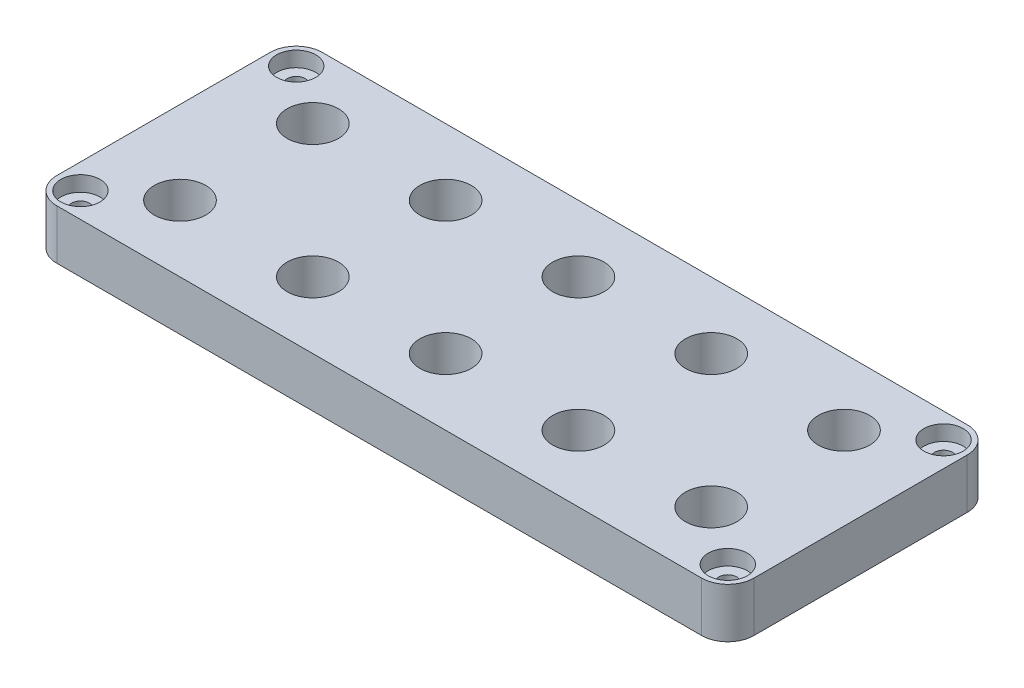
ISO-10303-21;
HEADER;
FILE_DESCRIPTION(('STEP AP214'),'2;1');
FILE_NAME('part.step','',(''),(''),'','','');
FILE_SCHEMA(('AUTOMOTIVE_DESIGN { 1 0 10303 214 1 1 1 1 }'));
ENDSEC;
DATA;
#1=APPLICATION_CONTEXT('core data for automotive mechanical design processes');
#2=APPLICATION_PROTOCOL_DEFINITION('international standard','automotive_design',2000,#1);
#3=PRODUCT_CONTEXT('',#1,'mechanical');
#4=PRODUCT('Part','Part','',(#3));
#5=PRODUCT_RELATED_PRODUCT_CATEGORY('part','',(#4));
#6=PRODUCT_DEFINITION_FORMATION('','',#4);
#7=PRODUCT_DEFINITION_CONTEXT('part definition',#1,'design');
#8=PRODUCT_DEFINITION('design','',#6,#7);
#9=PRODUCT_DEFINITION_SHAPE('','',#8);
#10=(LENGTH_UNIT() NAMED_UNIT(*) SI_UNIT(.MILLI.,.METRE.));
#11=(NAMED_UNIT(*) PLANE_ANGLE_UNIT() SI_UNIT($,.RADIAN.));
#12=(NAMED_UNIT(*) SI_UNIT($,.STERADIAN.) SOLID_ANGLE_UNIT());
#13=UNCERTAINTY_MEASURE_WITH_UNIT(LENGTH_MEASURE(1.E-05),#10,'distance_accuracy_value','');
#14=(GEOMETRIC_REPRESENTATION_CONTEXT(3) GLOBAL_UNCERTAINTY_ASSIGNED_CONTEXT((#13)) GLOBAL_UNIT_ASSIGNED_CONTEXT((#10,
#11,#12)) REPRESENTATION_CONTEXT('',''));
#15=CARTESIAN_POINT('',(0.,0.,0.));
#16=DIRECTION('',(0.,0.,1.));
#17=DIRECTION('',(1.,0.,0.));
#18=AXIS2_PLACEMENT_3D('',#15,#16,#17);
#19=CARTESIAN_POINT('',(9.525,19.05,-9.52500000000001));
#20=DIRECTION('',(0.,-1.,0.));
#21=DIRECTION('',(0.,0.,-1.));
#22=AXIS2_PLACEMENT_3D('',#19,#20,#21);
#23=CYLINDRICAL_SURFACE('',#22,3.42900000000001);
#24=CARTESIAN_POINT('',(9.525,0.,-9.52500000000001));
#25=DIRECTION('',(0.,1.,0.));
#26=DIRECTION('',(0.,0.,-1.));
#27=AXIS2_PLACEMENT_3D('',#24,#25,#26);
#28=CIRCLE('',#27,3.42900000000001);
#29=CARTESIAN_POINT('',(9.525,0.,-12.954));
#30=VERTEX_POINT('',#29);
#31=EDGE_CURVE('E194',#30,#30,#28,.T.);
#32=ORIENTED_EDGE('',*,*,#31,.F.);
#33=EDGE_LOOP('',(#32));
#34=FACE_BOUND('',#33,.T.);
#35=CARTESIAN_POINT('',(9.525,13.208,-9.52500000000001));
#36=DIRECTION('',(0.,1.,0.));
#37=DIRECTION('',(0.,0.,1.));
#38=AXIS2_PLACEMENT_3D('',#35,#36,#37);
#39=CIRCLE('',#38,3.42900000000001);
#40=CARTESIAN_POINT('',(9.525,13.208,-6.096));
#41=VERTEX_POINT('',#40);
#42=EDGE_CURVE('E37',#41,#41,#39,.T.);
#43=ORIENTED_EDGE('',*,*,#42,.T.);
#44=EDGE_LOOP('',(#43));
#45=FACE_BOUND('',#44,.T.);
#46=ADVANCED_FACE('F33',(#34,#45),#23,.F.);
#47=CARTESIAN_POINT('',(257.175,19.05,-9.52499999999998));
#48=DIRECTION('',(0.,-1.,0.));
#49=DIRECTION('',(0.,0.,-1.));
#50=AXIS2_PLACEMENT_3D('',#47,#48,#49);
#51=CYLINDRICAL_SURFACE('',#50,3.42899999999994);
#52=CARTESIAN_POINT('',(257.175,0.,-9.52499999999998));
#53=DIRECTION('',(0.,1.,0.));
#54=DIRECTION('',(0.,0.,1.));
#55=AXIS2_PLACEMENT_3D('',#52,#53,#54);
#56=CIRCLE('',#55,3.42899999999994);
#57=CARTESIAN_POINT('',(257.175,0.,-6.09600000000003));
#58=VERTEX_POINT('',#57);
#59=EDGE_CURVE('E161',#58,#58,#56,.T.);
#60=ORIENTED_EDGE('',*,*,#59,.F.);
#61=EDGE_LOOP('',(#60));
#62=FACE_BOUND('',#61,.T.);
#63=CARTESIAN_POINT('',(257.175,13.208,-9.52499999999998));
#64=DIRECTION('',(0.,1.,0.));
#65=DIRECTION('',(0.,0.,1.));
#66=AXIS2_PLACEMENT_3D('',#63,#64,#65);
#67=CIRCLE('',#66,3.42899999999994);
#68=CARTESIAN_POINT('',(257.175,13.208,-6.09600000000003));
#69=VERTEX_POINT('',#68);
#70=EDGE_CURVE('E167',#69,#69,#67,.T.);
#71=ORIENTED_EDGE('',*,*,#70,.T.);
#72=EDGE_LOOP('',(#71));
#73=FACE_BOUND('',#72,.T.);
#74=ADVANCED_FACE('F293',(#62,#73),#51,.F.);
#75=CARTESIAN_POINT('',(257.175,19.05,-92.075));
#76=DIRECTION('',(0.,-1.,0.));
#77=DIRECTION('',(0.,0.,-1.));
#78=AXIS2_PLACEMENT_3D('',#75,#76,#77);
#79=CYLINDRICAL_SURFACE('',#78,3.42899999999994);
#80=CARTESIAN_POINT('',(257.175,0.,-92.075));
#81=DIRECTION('',(0.,1.,0.));
#82=DIRECTION('',(0.,0.,-1.));
#83=AXIS2_PLACEMENT_3D('',#80,#81,#82);
#84=CIRCLE('',#83,3.42899999999994);
#85=CARTESIAN_POINT('',(257.175,0.,-95.504));
#86=VERTEX_POINT('',#85);
#87=EDGE_CURVE('E197',#86,#86,#84,.T.);
#88=ORIENTED_EDGE('',*,*,#87,.F.);
#89=EDGE_LOOP('',(#88));
#90=FACE_BOUND('',#89,.T.);
#91=CARTESIAN_POINT('',(257.175,13.208,-92.075));
#92=DIRECTION('',(0.,1.,0.));
#93=DIRECTION('',(0.,0.,1.));
#94=AXIS2_PLACEMENT_3D('',#91,#92,#93);
#95=CIRCLE('',#94,3.42899999999994);
#96=CARTESIAN_POINT('',(257.175,13.208,-88.6460000000001));
#97=VERTEX_POINT('',#96);
#98=EDGE_CURVE('E163',#97,#97,#95,.T.);
#99=ORIENTED_EDGE('',*,*,#98,.T.);
#100=EDGE_LOOP('',(#99));
#101=FACE_BOUND('',#100,.T.);
#102=ADVANCED_FACE('F299',(#90,#101),#79,.F.);
#103=CARTESIAN_POINT('',(9.525,19.05,-92.075));
#104=DIRECTION('',(0.,-1.,0.));
#105=DIRECTION('',(0.,0.,-1.));
#106=AXIS2_PLACEMENT_3D('',#103,#104,#105);
#107=CYLINDRICAL_SURFACE('',#106,3.42900000000001);
#108=CARTESIAN_POINT('',(9.525,0.,-92.075));
#109=DIRECTION('',(0.,1.,0.));
#110=DIRECTION('',(0.,0.,1.));
#111=AXIS2_PLACEMENT_3D('',#108,#109,#110);
#112=CIRCLE('',#111,3.42900000000001);
#113=CARTESIAN_POINT('',(9.525,0.,-88.646));
#114=VERTEX_POINT('',#113);
#115=EDGE_CURVE('E200',#114,#114,#112,.T.);
#116=ORIENTED_EDGE('',*,*,#115,.F.);
#117=EDGE_LOOP('',(#116));
#118=FACE_BOUND('',#117,.T.);
#119=CARTESIAN_POINT('',(9.525,13.208,-92.075));
#120=DIRECTION('',(0.,1.,0.));
#121=DIRECTION('',(0.,0.,1.));
#122=AXIS2_PLACEMENT_3D('',#119,#120,#121);
#123=CIRCLE('',#122,3.42900000000001);
#124=CARTESIAN_POINT('',(9.525,13.208,-88.646));
#125=VERTEX_POINT('',#124);
#126=EDGE_CURVE('E158',#125,#125,#123,.T.);
#127=ORIENTED_EDGE('',*,*,#126,.T.);
#128=EDGE_LOOP('',(#127));
#129=FACE_BOUND('',#128,.T.);
#130=ADVANCED_FACE('F308',(#118,#129),#107,.F.);
#131=CARTESIAN_POINT('',(0.,19.05,0.));
#132=DIRECTION('',(0.,-1.,0.));
#133=DIRECTION('',(0.,0.,-1.));
#134=AXIS2_PLACEMENT_3D('',#131,#132,#133);
#135=PLANE('',#134);
#136=CARTESIAN_POINT('',(9.52500000000086,19.05,-9.52499999999999));
#137=DIRECTION('',(0.,1.,0.));
#138=DIRECTION('',(0.,0.,1.));
#139=AXIS2_PLACEMENT_3D('',#136,#137,#138);
#140=CIRCLE('',#139,7.5);
#141=CARTESIAN_POINT('',(9.52500000000086,19.05,-2.02499999999999));
#142=VERTEX_POINT('',#141);
#143=EDGE_CURVE('E183',#142,#142,#140,.T.);
#144=ORIENTED_EDGE('',*,*,#143,.F.);
#145=EDGE_LOOP('',(#144));
#146=FACE_BOUND('',#145,.T.);
#147=CARTESIAN_POINT('',(257.175000000001,19.05,-9.52499999999999));
#148=DIRECTION('',(0.,1.,0.));
#149=DIRECTION('',(0.,0.,1.));
#150=AXIS2_PLACEMENT_3D('',#147,#148,#149);
#151=CIRCLE('',#150,7.50000000000001);
#152=CARTESIAN_POINT('',(257.175000000001,19.05,-2.02499999999998));
#153=VERTEX_POINT('',#152);
#154=EDGE_CURVE('E176',#153,#153,#151,.T.);
#155=ORIENTED_EDGE('',*,*,#154,.F.);
#156=EDGE_LOOP('',(#155));
#157=FACE_BOUND('',#156,.T.);
#158=CARTESIAN_POINT('',(257.175,19.05,-92.075));
#159=DIRECTION('',(0.,1.,0.));
#160=DIRECTION('',(0.,0.,1.));
#161=AXIS2_PLACEMENT_3D('',#158,#159,#160);
#162=CIRCLE('',#161,7.50000000000001);
#163=CARTESIAN_POINT('',(257.175,19.05,-84.575));
#164=VERTEX_POINT('',#163);
#165=EDGE_CURVE('E169',#164,#164,#162,.T.);
#166=ORIENTED_EDGE('',*,*,#165,.F.);
#167=EDGE_LOOP('',(#166));
#168=FACE_BOUND('',#167,.T.);
#169=CARTESIAN_POINT('',(9.525,19.05,-92.075));
#170=DIRECTION('',(0.,1.,0.));
#171=DIRECTION('',(0.,0.,1.));
#172=AXIS2_PLACEMENT_3D('',#169,#170,#171);
#173=CIRCLE('',#172,7.5);
#174=CARTESIAN_POINT('',(9.525,19.05,-84.575));
#175=VERTEX_POINT('',#174);
#176=EDGE_CURVE('E165',#175,#175,#173,.T.);
#177=ORIENTED_EDGE('',*,*,#176,.F.);
#178=EDGE_LOOP('',(#177));
#179=FACE_BOUND('',#178,.T.);
#180=CARTESIAN_POINT('',(234.95,19.05,-76.2));
#181=DIRECTION('',(0.,1.,0.));
#182=DIRECTION('',(0.,0.,1.));
#183=AXIS2_PLACEMENT_3D('',#180,#181,#182);
#184=CIRCLE('',#183,9.8425);
#185=CARTESIAN_POINT('',(234.95,19.05,-66.3575));
#186=VERTEX_POINT('',#185);
#187=EDGE_CURVE('E210',#186,#186,#184,.T.);
#188=ORIENTED_EDGE('',*,*,#187,.F.);
#189=EDGE_LOOP('',(#188));
#190=FACE_BOUND('',#189,.T.);
#191=CARTESIAN_POINT('',(133.35,19.05,-76.2));
#192=DIRECTION('',(0.,1.,0.));
#193=DIRECTION('',(0.,0.,1.));
#194=AXIS2_PLACEMENT_3D('',#191,#192,#193);
#195=CIRCLE('',#194,9.8425);
#196=CARTESIAN_POINT('',(133.35,19.05,-66.3575));
#197=VERTEX_POINT('',#196);
#198=EDGE_CURVE('E222',#197,#197,#195,.T.);
#199=ORIENTED_EDGE('',*,*,#198,.F.);
#200=EDGE_LOOP('',(#199));
#201=FACE_BOUND('',#200,.T.);
#202=CARTESIAN_POINT('',(234.95,19.05,-25.4));
#203=DIRECTION('',(0.,1.,0.));
#204=DIRECTION('',(0.,0.,1.));
#205=AXIS2_PLACEMENT_3D('',#202,#203,#204);
#206=CIRCLE('',#205,9.8425);
#207=CARTESIAN_POINT('',(234.95,19.05,-15.5575));
#208=VERTEX_POINT('',#207);
#209=EDGE_CURVE('E234',#208,#208,#206,.T.);
#210=ORIENTED_EDGE('',*,*,#209,.F.);
#211=EDGE_LOOP('',(#210));
#212=FACE_BOUND('',#211,.T.);
#213=CARTESIAN_POINT('',(133.35,19.05,-25.4));
#214=DIRECTION('',(0.,1.,0.));
#215=DIRECTION('',(0.,0.,1.));
#216=AXIS2_PLACEMENT_3D('',#213,#214,#215);
#217=CIRCLE('',#216,9.8425);
#218=CARTESIAN_POINT('',(133.35,19.05,-15.5575));
#219=VERTEX_POINT('',#218);
#220=EDGE_CURVE('E246',#219,#219,#217,.T.);
#221=ORIENTED_EDGE('',*,*,#220,.F.);
#222=EDGE_LOOP('',(#221));
#223=FACE_BOUND('',#222,.T.);
#224=CARTESIAN_POINT('',(31.75,19.05,-25.4));
#225=DIRECTION('',(0.,1.,0.));
#226=DIRECTION('',(0.,0.,1.));
#227=AXIS2_PLACEMENT_3D('',#224,#225,#226);
#228=CIRCLE('',#227,9.8425);
#229=CARTESIAN_POINT('',(31.75,19.05,-15.5575));
#230=VERTEX_POINT('',#229);
#231=EDGE_CURVE('E258',#230,#230,#228,.T.);
#232=ORIENTED_EDGE('',*,*,#231,.F.);
#233=EDGE_LOOP('',(#232));
#234=FACE_BOUND('',#233,.T.);
#235=DIRECTION('',(0.,0.,-1.));
#236=VECTOR('',#235,1.);
#237=CARTESIAN_POINT('',(266.7,19.05,0.));
#238=LINE('',#237,#236);
#239=CARTESIAN_POINT('',(266.7,19.05,-10.));
#240=VERTEX_POINT('',#239);
#241=CARTESIAN_POINT('',(266.7,19.05,-91.6));
#242=VERTEX_POINT('',#241);
#243=EDGE_CURVE('E265',#240,#242,#238,.T.);
#244=ORIENTED_EDGE('',*,*,#243,.T.);
#245=CARTESIAN_POINT('',(256.7,19.05,-91.6));
#246=DIRECTION('',(0.,-1.,0.));
#247=DIRECTION('',(0.,0.,-1.));
#248=AXIS2_PLACEMENT_3D('',#245,#246,#247);
#249=CIRCLE('',#248,10.);
#250=CARTESIAN_POINT('',(256.7,19.05,-101.6));
#251=VERTEX_POINT('',#250);
#252=EDGE_CURVE('E150',#242,#251,#249,.F.);
#253=ORIENTED_EDGE('',*,*,#252,.T.);
#254=DIRECTION('',(-1.,0.,0.));
#255=VECTOR('',#254,1.);
#256=CARTESIAN_POINT('',(0.,19.05,-101.6));
#257=LINE('',#256,#255);
#258=CARTESIAN_POINT('',(10.,19.05,-101.6));
#259=VERTEX_POINT('',#258);
#260=EDGE_CURVE('E121',#251,#259,#257,.T.);
#261=ORIENTED_EDGE('',*,*,#260,.T.);
#262=CARTESIAN_POINT('',(10.,19.05,-91.6));
#263=DIRECTION('',(0.,-1.,0.));
#264=DIRECTION('',(0.,0.,-1.));
#265=AXIS2_PLACEMENT_3D('',#262,#263,#264);
#266=CIRCLE('',#265,10.);
#267=CARTESIAN_POINT('',(0.,19.05,-91.6));
#268=VERTEX_POINT('',#267);
#269=EDGE_CURVE('E145',#259,#268,#266,.F.);
#270=ORIENTED_EDGE('',*,*,#269,.T.);
#271=DIRECTION('',(0.,0.,1.));
#272=VECTOR('',#271,1.);
#273=CARTESIAN_POINT('',(0.,19.05,0.));
#274=LINE('',#273,#272);
#275=CARTESIAN_POINT('',(0.,19.05,-10.));
#276=VERTEX_POINT('',#275);
#277=EDGE_CURVE('E128',#268,#276,#274,.T.);
#278=ORIENTED_EDGE('',*,*,#277,.T.);
#279=CARTESIAN_POINT('',(10.,19.05,-10.));
#280=DIRECTION('',(0.,-1.,0.));
#281=DIRECTION('',(0.,0.,-1.));
#282=AXIS2_PLACEMENT_3D('',#279,#280,#281);
#283=CIRCLE('',#282,10.);
#284=CARTESIAN_POINT('',(10.,19.05,0.));
#285=VERTEX_POINT('',#284);
#286=EDGE_CURVE('E57',#276,#285,#283,.F.);
#287=ORIENTED_EDGE('',*,*,#286,.T.);
#288=DIRECTION('',(1.,0.,0.));
#289=VECTOR('',#288,1.);
#290=CARTESIAN_POINT('',(0.,19.05,0.));
#291=LINE('',#290,#289);
#292=CARTESIAN_POINT('',(256.7,19.05,0.));
#293=VERTEX_POINT('',#292);
#294=EDGE_CURVE('E131',#285,#293,#291,.T.);
#295=ORIENTED_EDGE('',*,*,#294,.T.);
#296=CARTESIAN_POINT('',(256.7,19.05,-10.));
#297=DIRECTION('',(0.,-1.,0.));
#298=DIRECTION('',(0.,0.,-1.));
#299=AXIS2_PLACEMENT_3D('',#296,#297,#298);
#300=CIRCLE('',#299,10.);
#301=EDGE_CURVE('E148',#293,#240,#300,.F.);
#302=ORIENTED_EDGE('',*,*,#301,.T.);
#303=EDGE_LOOP('',(#244,#253,#261,#270,#278,#287,#295,#302));
#304=FACE_BOUND('',#303,.T.);
#305=CARTESIAN_POINT('',(82.55,19.05,-25.4));
#306=DIRECTION('',(0.,1.,0.));
#307=DIRECTION('',(0.,0.,1.));
#308=AXIS2_PLACEMENT_3D('',#305,#306,#307);
#309=CIRCLE('',#308,9.8425);
#310=CARTESIAN_POINT('',(82.55,19.05,-15.5575));
#311=VERTEX_POINT('',#310);
#312=EDGE_CURVE('E252',#311,#311,#309,.T.);
#313=ORIENTED_EDGE('',*,*,#312,.F.);
#314=EDGE_LOOP('',(#313));
#315=FACE_BOUND('',#314,.T.);
#316=CARTESIAN_POINT('',(184.15,19.05,-25.4));
#317=DIRECTION('',(0.,1.,0.));
#318=DIRECTION('',(0.,0.,1.));
#319=AXIS2_PLACEMENT_3D('',#316,#317,#318);
#320=CIRCLE('',#319,9.8425);
#321=CARTESIAN_POINT('',(184.15,19.05,-15.5575));
#322=VERTEX_POINT('',#321);
#323=EDGE_CURVE('E240',#322,#322,#320,.T.);
#324=ORIENTED_EDGE('',*,*,#323,.F.);
#325=EDGE_LOOP('',(#324));
#326=FACE_BOUND('',#325,.T.);
#327=CARTESIAN_POINT('',(82.5499999999998,19.05,-76.2));
#328=DIRECTION('',(0.,1.,0.));
#329=DIRECTION('',(0.,0.,1.));
#330=AXIS2_PLACEMENT_3D('',#327,#328,#329);
#331=CIRCLE('',#330,9.8425);
#332=CARTESIAN_POINT('',(82.5499999999998,19.05,-66.3575));
#333=VERTEX_POINT('',#332);
#334=EDGE_CURVE('E228',#333,#333,#331,.T.);
#335=ORIENTED_EDGE('',*,*,#334,.F.);
#336=EDGE_LOOP('',(#335));
#337=FACE_BOUND('',#336,.T.);
#338=CARTESIAN_POINT('',(184.15,19.05,-76.2));
#339=DIRECTION('',(0.,1.,0.));
#340=DIRECTION('',(0.,0.,1.));
#341=AXIS2_PLACEMENT_3D('',#338,#339,#340);
#342=CIRCLE('',#341,9.8425);
#343=CARTESIAN_POINT('',(184.15,19.05,-66.3575));
#344=VERTEX_POINT('',#343);
#345=EDGE_CURVE('E216',#344,#344,#342,.T.);
#346=ORIENTED_EDGE('',*,*,#345,.F.);
#347=EDGE_LOOP('',(#346));
#348=FACE_BOUND('',#347,.T.);
#349=CARTESIAN_POINT('',(31.7499999999998,19.05,-76.2));
#350=DIRECTION('',(0.,1.,0.));
#351=DIRECTION('',(0.,0.,1.));
#352=AXIS2_PLACEMENT_3D('',#349,#350,#351);
#353=CIRCLE('',#352,9.8425);
#354=CARTESIAN_POINT('',(31.7499999999998,19.05,-66.3575));
#355=VERTEX_POINT('',#354);
#356=EDGE_CURVE('E204',#355,#355,#353,.T.);
#357=ORIENTED_EDGE('',*,*,#356,.F.);
#358=EDGE_LOOP('',(#357));
#359=FACE_BOUND('',#358,.T.);
#360=ADVANCED_FACE('F278',(#146,#157,#168,#179,#190,#201,#212,#223,#234,#304,#315,#326,#337,
#348,#359),#135,.F.);
#361=CARTESIAN_POINT('',(0.,0.,0.));
#362=DIRECTION('',(0.,-1.,0.));
#363=DIRECTION('',(0.,0.,-1.));
#364=AXIS2_PLACEMENT_3D('',#361,#362,#363);
#365=PLANE('',#364);
#366=ORIENTED_EDGE('',*,*,#31,.T.);
#367=EDGE_LOOP('',(#366));
#368=FACE_BOUND('',#367,.T.);
#369=ORIENTED_EDGE('',*,*,#115,.T.);
#370=EDGE_LOOP('',(#369));
#371=FACE_BOUND('',#370,.T.);
#372=CARTESIAN_POINT('',(234.95,0.,-76.2));
#373=DIRECTION('',(0.,1.,0.));
#374=DIRECTION('',(0.,0.,1.));
#375=AXIS2_PLACEMENT_3D('',#372,#373,#374);
#376=CIRCLE('',#375,9.8425);
#377=CARTESIAN_POINT('',(234.95,0.,-66.3575));
#378=VERTEX_POINT('',#377);
#379=EDGE_CURVE('E207',#378,#378,#376,.T.);
#380=ORIENTED_EDGE('',*,*,#379,.T.);
#381=EDGE_LOOP('',(#380));
#382=FACE_BOUND('',#381,.T.);
#383=CARTESIAN_POINT('',(133.35,0.,-76.2));
#384=DIRECTION('',(0.,1.,0.));
#385=DIRECTION('',(0.,0.,1.));
#386=AXIS2_PLACEMENT_3D('',#383,#384,#385);
#387=CIRCLE('',#386,9.8425);
#388=CARTESIAN_POINT('',(133.35,0.,-66.3575));
#389=VERTEX_POINT('',#388);
#390=EDGE_CURVE('E219',#389,#389,#387,.T.);
#391=ORIENTED_EDGE('',*,*,#390,.T.);
#392=EDGE_LOOP('',(#391));
#393=FACE_BOUND('',#392,.T.);
#394=CARTESIAN_POINT('',(234.95,0.,-25.4));
#395=DIRECTION('',(0.,1.,0.));
#396=DIRECTION('',(0.,0.,1.));
#397=AXIS2_PLACEMENT_3D('',#394,#395,#396);
#398=CIRCLE('',#397,9.8425);
#399=CARTESIAN_POINT('',(234.95,0.,-15.5575));
#400=VERTEX_POINT('',#399);
#401=EDGE_CURVE('E231',#400,#400,#398,.T.);
#402=ORIENTED_EDGE('',*,*,#401,.T.);
#403=EDGE_LOOP('',(#402));
#404=FACE_BOUND('',#403,.T.);
#405=CARTESIAN_POINT('',(133.35,0.,-25.4));
#406=DIRECTION('',(0.,1.,0.));
#407=DIRECTION('',(0.,0.,1.));
#408=AXIS2_PLACEMENT_3D('',#405,#406,#407);
#409=CIRCLE('',#408,9.8425);
#410=CARTESIAN_POINT('',(133.35,0.,-15.5575));
#411=VERTEX_POINT('',#410);
#412=EDGE_CURVE('E243',#411,#411,#409,.T.);
#413=ORIENTED_EDGE('',*,*,#412,.T.);
#414=EDGE_LOOP('',(#413));
#415=FACE_BOUND('',#414,.T.);
#416=CARTESIAN_POINT('',(31.75,0.,-25.4));
#417=DIRECTION('',(0.,1.,0.));
#418=DIRECTION('',(0.,0.,1.));
#419=AXIS2_PLACEMENT_3D('',#416,#417,#418);
#420=CIRCLE('',#419,9.8425);
#421=CARTESIAN_POINT('',(31.75,0.,-15.5575));
#422=VERTEX_POINT('',#421);
#423=EDGE_CURVE('E255',#422,#422,#420,.T.);
#424=ORIENTED_EDGE('',*,*,#423,.T.);
#425=EDGE_LOOP('',(#424));
#426=FACE_BOUND('',#425,.T.);
#427=DIRECTION('',(-1.,0.,0.));
#428=VECTOR('',#427,1.);
#429=CARTESIAN_POINT('',(0.,0.,-101.6));
#430=LINE('',#429,#428);
#431=CARTESIAN_POINT('',(256.7,0.,-101.6));
#432=VERTEX_POINT('',#431);
#433=CARTESIAN_POINT('',(10.,0.,-101.6));
#434=VERTEX_POINT('',#433);
#435=EDGE_CURVE('E118',#432,#434,#430,.T.);
#436=ORIENTED_EDGE('',*,*,#435,.F.);
#437=CARTESIAN_POINT('',(256.7,0.,-91.6));
#438=DIRECTION('',(0.,-1.,0.));
#439=DIRECTION('',(0.,0.,-1.));
#440=AXIS2_PLACEMENT_3D('',#437,#438,#439);
#441=CIRCLE('',#440,10.);
#442=CARTESIAN_POINT('',(266.7,0.,-91.6));
#443=VERTEX_POINT('',#442);
#444=EDGE_CURVE('E101',#432,#443,#441,.T.);
#445=ORIENTED_EDGE('',*,*,#444,.T.);
#446=DIRECTION('',(0.,0.,-1.));
#447=VECTOR('',#446,1.);
#448=CARTESIAN_POINT('',(266.7,0.,0.));
#449=LINE('',#448,#447);
#450=CARTESIAN_POINT('',(266.7,0.,-10.));
#451=VERTEX_POINT('',#450);
#452=EDGE_CURVE('E129',#451,#443,#449,.T.);
#453=ORIENTED_EDGE('',*,*,#452,.F.);
#454=CARTESIAN_POINT('',(256.7,0.,-10.));
#455=DIRECTION('',(0.,-1.,0.));
#456=DIRECTION('',(0.,0.,-1.));
#457=AXIS2_PLACEMENT_3D('',#454,#455,#456);
#458=CIRCLE('',#457,10.);
#459=CARTESIAN_POINT('',(256.7,0.,0.));
#460=VERTEX_POINT('',#459);
#461=EDGE_CURVE('E112',#451,#460,#458,.T.);
#462=ORIENTED_EDGE('',*,*,#461,.T.);
#463=DIRECTION('',(1.,0.,0.));
#464=VECTOR('',#463,1.);
#465=CARTESIAN_POINT('',(0.,0.,0.));
#466=LINE('',#465,#464);
#467=CARTESIAN_POINT('',(10.,0.,0.));
#468=VERTEX_POINT('',#467);
#469=EDGE_CURVE('E133',#468,#460,#466,.T.);
#470=ORIENTED_EDGE('',*,*,#469,.F.);
#471=CARTESIAN_POINT('',(10.,0.,-10.));
#472=DIRECTION('',(0.,-1.,0.));
#473=DIRECTION('',(0.,0.,-1.));
#474=AXIS2_PLACEMENT_3D('',#471,#472,#473);
#475=CIRCLE('',#474,10.);
#476=CARTESIAN_POINT('',(0.,0.,-10.));
#477=VERTEX_POINT('',#476);
#478=EDGE_CURVE('E139',#468,#477,#475,.T.);
#479=ORIENTED_EDGE('',*,*,#478,.T.);
#480=DIRECTION('',(0.,0.,1.));
#481=VECTOR('',#480,1.);
#482=CARTESIAN_POINT('',(0.,0.,0.));
#483=LINE('',#482,#481);
#484=CARTESIAN_POINT('',(0.,0.,-91.6));
#485=VERTEX_POINT('',#484);
#486=EDGE_CURVE('E261',#485,#477,#483,.T.);
#487=ORIENTED_EDGE('',*,*,#486,.F.);
#488=CARTESIAN_POINT('',(10.,0.,-91.6));
#489=DIRECTION('',(0.,-1.,0.));
#490=DIRECTION('',(0.,0.,-1.));
#491=AXIS2_PLACEMENT_3D('',#488,#489,#490);
#492=CIRCLE('',#491,10.);
#493=EDGE_CURVE('E122',#485,#434,#492,.T.);
#494=ORIENTED_EDGE('',*,*,#493,.T.);
#495=EDGE_LOOP('',(#436,#445,#453,#462,#470,#479,#487,#494));
#496=FACE_BOUND('',#495,.T.);
#497=CARTESIAN_POINT('',(82.55,0.,-25.4));
#498=DIRECTION('',(0.,1.,0.));
#499=DIRECTION('',(0.,0.,1.));
#500=AXIS2_PLACEMENT_3D('',#497,#498,#499);
#501=CIRCLE('',#500,9.8425);
#502=CARTESIAN_POINT('',(82.55,0.,-15.5575));
#503=VERTEX_POINT('',#502);
#504=EDGE_CURVE('E249',#503,#503,#501,.T.);
#505=ORIENTED_EDGE('',*,*,#504,.T.);
#506=EDGE_LOOP('',(#505));
#507=FACE_BOUND('',#506,.T.);
#508=CARTESIAN_POINT('',(184.15,0.,-25.4));
#509=DIRECTION('',(0.,1.,0.));
#510=DIRECTION('',(0.,0.,1.));
#511=AXIS2_PLACEMENT_3D('',#508,#509,#510);
#512=CIRCLE('',#511,9.8425);
#513=CARTESIAN_POINT('',(184.15,0.,-15.5575));
#514=VERTEX_POINT('',#513);
#515=EDGE_CURVE('E237',#514,#514,#512,.T.);
#516=ORIENTED_EDGE('',*,*,#515,.T.);
#517=EDGE_LOOP('',(#516));
#518=FACE_BOUND('',#517,.T.);
#519=CARTESIAN_POINT('',(82.5499999999998,0.,-76.2));
#520=DIRECTION('',(0.,1.,0.));
#521=DIRECTION('',(0.,0.,1.));
#522=AXIS2_PLACEMENT_3D('',#519,#520,#521);
#523=CIRCLE('',#522,9.8425);
#524=CARTESIAN_POINT('',(82.5499999999998,0.,-66.3575));
#525=VERTEX_POINT('',#524);
#526=EDGE_CURVE('E225',#525,#525,#523,.T.);
#527=ORIENTED_EDGE('',*,*,#526,.T.);
#528=EDGE_LOOP('',(#527));
#529=FACE_BOUND('',#528,.T.);
#530=CARTESIAN_POINT('',(184.15,0.,-76.2));
#531=DIRECTION('',(0.,1.,0.));
#532=DIRECTION('',(0.,0.,1.));
#533=AXIS2_PLACEMENT_3D('',#530,#531,#532);
#534=CIRCLE('',#533,9.8425);
#535=CARTESIAN_POINT('',(184.15,0.,-66.3575));
#536=VERTEX_POINT('',#535);
#537=EDGE_CURVE('E213',#536,#536,#534,.T.);
#538=ORIENTED_EDGE('',*,*,#537,.T.);
#539=EDGE_LOOP('',(#538));
#540=FACE_BOUND('',#539,.T.);
#541=CARTESIAN_POINT('',(31.7499999999998,0.,-76.2));
#542=DIRECTION('',(0.,1.,0.));
#543=DIRECTION('',(0.,0.,1.));
#544=AXIS2_PLACEMENT_3D('',#541,#542,#543);
#545=CIRCLE('',#544,9.8425);
#546=CARTESIAN_POINT('',(31.7499999999998,0.,-66.3575));
#547=VERTEX_POINT('',#546);
#548=EDGE_CURVE('E203',#547,#547,#545,.T.);
#549=ORIENTED_EDGE('',*,*,#548,.T.);
#550=EDGE_LOOP('',(#549));
#551=FACE_BOUND('',#550,.T.);
#552=ORIENTED_EDGE('',*,*,#87,.T.);
#553=EDGE_LOOP('',(#552));
#554=FACE_BOUND('',#553,.T.);
#555=ORIENTED_EDGE('',*,*,#59,.T.);
#556=EDGE_LOOP('',(#555));
#557=FACE_BOUND('',#556,.T.);
#558=ADVANCED_FACE('F125',(#368,#371,#382,#393,#404,#415,#426,#496,#507,#518,#529,#540,#551,
#554,#557),#365,.T.);
#559=CARTESIAN_POINT('',(0.,19.05,0.));
#560=DIRECTION('',(1.,0.,0.));
#561=DIRECTION('',(0.,0.,-1.));
#562=AXIS2_PLACEMENT_3D('',#559,#560,#561);
#563=PLANE('',#562);
#564=ORIENTED_EDGE('',*,*,#486,.T.);
#565=DIRECTION('',(0.,-1.,0.));
#566=VECTOR('',#565,1.);
#567=CARTESIAN_POINT('',(0.,19.05,-10.));
#568=LINE('',#567,#566);
#569=EDGE_CURVE('E11',#477,#276,#568,.F.);
#570=ORIENTED_EDGE('',*,*,#569,.T.);
#571=ORIENTED_EDGE('',*,*,#277,.F.);
#572=DIRECTION('',(0.,-1.,0.));
#573=VECTOR('',#572,1.);
#574=CARTESIAN_POINT('',(0.,19.05,-91.6));
#575=LINE('',#574,#573);
#576=EDGE_CURVE('E42',#268,#485,#575,.T.);
#577=ORIENTED_EDGE('',*,*,#576,.T.);
#578=EDGE_LOOP('',(#564,#570,#571,#577));
#579=FACE_BOUND('',#578,.T.);
#580=ADVANCED_FACE('F290',(#579),#563,.F.);
#581=CARTESIAN_POINT('',(0.,19.05,0.));
#582=DIRECTION('',(0.,0.,-1.));
#583=DIRECTION('',(-1.,0.,0.));
#584=AXIS2_PLACEMENT_3D('',#581,#582,#583);
#585=PLANE('',#584);
#586=ORIENTED_EDGE('',*,*,#469,.T.);
#587=DIRECTION('',(0.,-1.,0.));
#588=VECTOR('',#587,1.);
#589=CARTESIAN_POINT('',(256.7,19.05,0.));
#590=LINE('',#589,#588);
#591=EDGE_CURVE('E50',#460,#293,#590,.F.);
#592=ORIENTED_EDGE('',*,*,#591,.T.);
#593=ORIENTED_EDGE('',*,*,#294,.F.);
#594=DIRECTION('',(0.,-1.,0.));
#595=VECTOR('',#594,1.);
#596=CARTESIAN_POINT('',(10.,19.05,0.));
#597=LINE('',#596,#595);
#598=EDGE_CURVE('E152',#285,#468,#597,.T.);
#599=ORIENTED_EDGE('',*,*,#598,.T.);
#600=EDGE_LOOP('',(#586,#592,#593,#599));
#601=FACE_BOUND('',#600,.T.);
#602=ADVANCED_FACE('F271',(#601),#585,.F.);
#603=CARTESIAN_POINT('',(266.7,19.05,0.));
#604=DIRECTION('',(-1.,0.,0.));
#605=DIRECTION('',(0.,0.,1.));
#606=AXIS2_PLACEMENT_3D('',#603,#604,#605);
#607=PLANE('',#606);
#608=ORIENTED_EDGE('',*,*,#452,.T.);
#609=DIRECTION('',(0.,-1.,0.));
#610=VECTOR('',#609,1.);
#611=CARTESIAN_POINT('',(266.7,19.05,-91.6));
#612=LINE('',#611,#610);
#613=EDGE_CURVE('E106',#443,#242,#612,.F.);
#614=ORIENTED_EDGE('',*,*,#613,.T.);
#615=ORIENTED_EDGE('',*,*,#243,.F.);
#616=DIRECTION('',(0.,-1.,0.));
#617=VECTOR('',#616,1.);
#618=CARTESIAN_POINT('',(266.7,19.05,-10.));
#619=LINE('',#618,#617);
#620=EDGE_CURVE('E111',#240,#451,#619,.T.);
#621=ORIENTED_EDGE('',*,*,#620,.T.);
#622=EDGE_LOOP('',(#608,#614,#615,#621));
#623=FACE_BOUND('',#622,.T.);
#624=ADVANCED_FACE('F281',(#623),#607,.F.);
#625=CARTESIAN_POINT('',(0.,19.05,-101.6));
#626=DIRECTION('',(0.,0.,1.));
#627=DIRECTION('',(1.,0.,0.));
#628=AXIS2_PLACEMENT_3D('',#625,#626,#627);
#629=PLANE('',#628);
#630=ORIENTED_EDGE('',*,*,#260,.F.);
#631=DIRECTION('',(0.,-1.,0.));
#632=VECTOR('',#631,1.);
#633=CARTESIAN_POINT('',(256.7,19.05,-101.6));
#634=LINE('',#633,#632);
#635=EDGE_CURVE('E105',#251,#432,#634,.T.);
#636=ORIENTED_EDGE('',*,*,#635,.T.);
#637=ORIENTED_EDGE('',*,*,#435,.T.);
#638=DIRECTION('',(0.,-1.,0.));
#639=VECTOR('',#638,1.);
#640=CARTESIAN_POINT('',(10.,19.05,-101.6));
#641=LINE('',#640,#639);
#642=EDGE_CURVE('E123',#434,#259,#641,.F.);
#643=ORIENTED_EDGE('',*,*,#642,.T.);
#644=EDGE_LOOP('',(#630,#636,#637,#643));
#645=FACE_BOUND('',#644,.T.);
#646=ADVANCED_FACE('F117',(#645),#629,.F.);
#647=CARTESIAN_POINT('',(31.75,19.05,-25.4));
#648=DIRECTION('',(0.,-1.,0.));
#649=DIRECTION('',(0.,0.,-1.));
#650=AXIS2_PLACEMENT_3D('',#647,#648,#649);
#651=CYLINDRICAL_SURFACE('',#650,9.8425);
#652=ORIENTED_EDGE('',*,*,#231,.T.);
#653=EDGE_LOOP('',(#652));
#654=FACE_BOUND('',#653,.T.);
#655=ORIENTED_EDGE('',*,*,#423,.F.);
#656=EDGE_LOOP('',(#655));
#657=FACE_BOUND('',#656,.T.);
#658=ADVANCED_FACE('F288',(#654,#657),#651,.F.);
#659=CARTESIAN_POINT('',(82.55,19.05,-25.4));
#660=DIRECTION('',(0.,-1.,0.));
#661=DIRECTION('',(0.,0.,-1.));
#662=AXIS2_PLACEMENT_3D('',#659,#660,#661);
#663=CYLINDRICAL_SURFACE('',#662,9.8425);
#664=ORIENTED_EDGE('',*,*,#312,.T.);
#665=EDGE_LOOP('',(#664));
#666=FACE_BOUND('',#665,.T.);
#667=ORIENTED_EDGE('',*,*,#504,.F.);
#668=EDGE_LOOP('',(#667));
#669=FACE_BOUND('',#668,.T.);
#670=ADVANCED_FACE('F344',(#666,#669),#663,.F.);
#671=CARTESIAN_POINT('',(133.35,19.05,-25.4));
#672=DIRECTION('',(0.,-1.,0.));
#673=DIRECTION('',(0.,0.,-1.));
#674=AXIS2_PLACEMENT_3D('',#671,#672,#673);
#675=CYLINDRICAL_SURFACE('',#674,9.8425);
#676=ORIENTED_EDGE('',*,*,#220,.T.);
#677=EDGE_LOOP('',(#676));
#678=FACE_BOUND('',#677,.T.);
#679=ORIENTED_EDGE('',*,*,#412,.F.);
#680=EDGE_LOOP('',(#679));
#681=FACE_BOUND('',#680,.T.);
#682=ADVANCED_FACE('F340',(#678,#681),#675,.F.);
#683=CARTESIAN_POINT('',(184.15,19.05,-25.4));
#684=DIRECTION('',(0.,-1.,0.));
#685=DIRECTION('',(0.,0.,-1.));
#686=AXIS2_PLACEMENT_3D('',#683,#684,#685);
#687=CYLINDRICAL_SURFACE('',#686,9.8425);
#688=ORIENTED_EDGE('',*,*,#323,.T.);
#689=EDGE_LOOP('',(#688));
#690=FACE_BOUND('',#689,.T.);
#691=ORIENTED_EDGE('',*,*,#515,.F.);
#692=EDGE_LOOP('',(#691));
#693=FACE_BOUND('',#692,.T.);
#694=ADVANCED_FACE('F336',(#690,#693),#687,.F.);
#695=CARTESIAN_POINT('',(234.95,19.05,-25.4));
#696=DIRECTION('',(0.,-1.,0.));
#697=DIRECTION('',(0.,0.,-1.));
#698=AXIS2_PLACEMENT_3D('',#695,#696,#697);
#699=CYLINDRICAL_SURFACE('',#698,9.8425);
#700=ORIENTED_EDGE('',*,*,#209,.T.);
#701=EDGE_LOOP('',(#700));
#702=FACE_BOUND('',#701,.T.);
#703=ORIENTED_EDGE('',*,*,#401,.F.);
#704=EDGE_LOOP('',(#703));
#705=FACE_BOUND('',#704,.T.);
#706=ADVANCED_FACE('F332',(#702,#705),#699,.F.);
#707=CARTESIAN_POINT('',(82.5499999999998,19.05,-76.2));
#708=DIRECTION('',(0.,-1.,0.));
#709=DIRECTION('',(0.,0.,-1.));
#710=AXIS2_PLACEMENT_3D('',#707,#708,#709);
#711=CYLINDRICAL_SURFACE('',#710,9.8425);
#712=ORIENTED_EDGE('',*,*,#334,.T.);
#713=EDGE_LOOP('',(#712));
#714=FACE_BOUND('',#713,.T.);
#715=ORIENTED_EDGE('',*,*,#526,.F.);
#716=EDGE_LOOP('',(#715));
#717=FACE_BOUND('',#716,.T.);
#718=ADVANCED_FACE('F328',(#714,#717),#711,.F.);
#719=CARTESIAN_POINT('',(133.35,19.05,-76.2));
#720=DIRECTION('',(0.,-1.,0.));
#721=DIRECTION('',(0.,0.,-1.));
#722=AXIS2_PLACEMENT_3D('',#719,#720,#721);
#723=CYLINDRICAL_SURFACE('',#722,9.8425);
#724=ORIENTED_EDGE('',*,*,#198,.T.);
#725=EDGE_LOOP('',(#724));
#726=FACE_BOUND('',#725,.T.);
#727=ORIENTED_EDGE('',*,*,#390,.F.);
#728=EDGE_LOOP('',(#727));
#729=FACE_BOUND('',#728,.T.);
#730=ADVANCED_FACE('F324',(#726,#729),#723,.F.);
#731=CARTESIAN_POINT('',(184.15,19.05,-76.2));
#732=DIRECTION('',(0.,-1.,0.));
#733=DIRECTION('',(0.,0.,-1.));
#734=AXIS2_PLACEMENT_3D('',#731,#732,#733);
#735=CYLINDRICAL_SURFACE('',#734,9.8425);
#736=ORIENTED_EDGE('',*,*,#345,.T.);
#737=EDGE_LOOP('',(#736));
#738=FACE_BOUND('',#737,.T.);
#739=ORIENTED_EDGE('',*,*,#537,.F.);
#740=EDGE_LOOP('',(#739));
#741=FACE_BOUND('',#740,.T.);
#742=ADVANCED_FACE('F320',(#738,#741),#735,.F.);
#743=CARTESIAN_POINT('',(234.95,19.05,-76.2));
#744=DIRECTION('',(0.,-1.,0.));
#745=DIRECTION('',(0.,0.,-1.));
#746=AXIS2_PLACEMENT_3D('',#743,#744,#745);
#747=CYLINDRICAL_SURFACE('',#746,9.8425);
#748=ORIENTED_EDGE('',*,*,#187,.T.);
#749=EDGE_LOOP('',(#748));
#750=FACE_BOUND('',#749,.T.);
#751=ORIENTED_EDGE('',*,*,#379,.F.);
#752=EDGE_LOOP('',(#751));
#753=FACE_BOUND('',#752,.T.);
#754=ADVANCED_FACE('F316',(#750,#753),#747,.F.);
#755=CARTESIAN_POINT('',(31.7499999999998,19.05,-76.2));
#756=DIRECTION('',(0.,-1.,0.));
#757=DIRECTION('',(0.,0.,-1.));
#758=AXIS2_PLACEMENT_3D('',#755,#756,#757);
#759=CYLINDRICAL_SURFACE('',#758,9.8425);
#760=ORIENTED_EDGE('',*,*,#356,.T.);
#761=EDGE_LOOP('',(#760));
#762=FACE_BOUND('',#761,.T.);
#763=ORIENTED_EDGE('',*,*,#548,.F.);
#764=EDGE_LOOP('',(#763));
#765=FACE_BOUND('',#764,.T.);
#766=ADVANCED_FACE('F313',(#762,#765),#759,.F.);
#767=CARTESIAN_POINT('',(256.7,19.05,-91.6));
#768=DIRECTION('',(0.,-1.,0.));
#769=DIRECTION('',(0.,0.,-1.));
#770=AXIS2_PLACEMENT_3D('',#767,#768,#769);
#771=CYLINDRICAL_SURFACE('',#770,10.);
#772=ORIENTED_EDGE('',*,*,#252,.F.);
#773=ORIENTED_EDGE('',*,*,#613,.F.);
#774=ORIENTED_EDGE('',*,*,#444,.F.);
#775=ORIENTED_EDGE('',*,*,#635,.F.);
#776=EDGE_LOOP('',(#772,#773,#774,#775));
#777=FACE_BOUND('',#776,.T.);
#778=ADVANCED_FACE('F104',(#777),#771,.T.);
#779=CARTESIAN_POINT('',(256.7,19.05,-10.));
#780=DIRECTION('',(0.,-1.,0.));
#781=DIRECTION('',(0.,0.,-1.));
#782=AXIS2_PLACEMENT_3D('',#779,#780,#781);
#783=CYLINDRICAL_SURFACE('',#782,10.);
#784=ORIENTED_EDGE('',*,*,#301,.F.);
#785=ORIENTED_EDGE('',*,*,#591,.F.);
#786=ORIENTED_EDGE('',*,*,#461,.F.);
#787=ORIENTED_EDGE('',*,*,#620,.F.);
#788=EDGE_LOOP('',(#784,#785,#786,#787));
#789=FACE_BOUND('',#788,.T.);
#790=ADVANCED_FACE('F275',(#789),#783,.T.);
#791=CARTESIAN_POINT('',(10.,19.05,-10.));
#792=DIRECTION('',(0.,-1.,0.));
#793=DIRECTION('',(0.,0.,-1.));
#794=AXIS2_PLACEMENT_3D('',#791,#792,#793);
#795=CYLINDRICAL_SURFACE('',#794,10.);
#796=ORIENTED_EDGE('',*,*,#286,.F.);
#797=ORIENTED_EDGE('',*,*,#569,.F.);
#798=ORIENTED_EDGE('',*,*,#478,.F.);
#799=ORIENTED_EDGE('',*,*,#598,.F.);
#800=EDGE_LOOP('',(#796,#797,#798,#799));
#801=FACE_BOUND('',#800,.T.);
#802=ADVANCED_FACE('F407',(#801),#795,.T.);
#803=CARTESIAN_POINT('',(10.,19.05,-91.6));
#804=DIRECTION('',(0.,-1.,0.));
#805=DIRECTION('',(0.,0.,-1.));
#806=AXIS2_PLACEMENT_3D('',#803,#804,#805);
#807=CYLINDRICAL_SURFACE('',#806,10.);
#808=ORIENTED_EDGE('',*,*,#269,.F.);
#809=ORIENTED_EDGE('',*,*,#642,.F.);
#810=ORIENTED_EDGE('',*,*,#493,.F.);
#811=ORIENTED_EDGE('',*,*,#576,.F.);
#812=EDGE_LOOP('',(#808,#809,#810,#811));
#813=FACE_BOUND('',#812,.T.);
#814=ADVANCED_FACE('F35',(#813),#807,.T.);
#815=CARTESIAN_POINT('',(9.525,13.208,-92.075));
#816=DIRECTION('',(0.,1.,0.));
#817=DIRECTION('',(0.,0.,1.));
#818=AXIS2_PLACEMENT_3D('',#815,#816,#817);
#819=CYLINDRICAL_SURFACE('',#818,7.5);
#820=CARTESIAN_POINT('',(9.525,13.208,-92.075));
#821=DIRECTION('',(0.,1.,0.));
#822=DIRECTION('',(0.,0.,1.));
#823=AXIS2_PLACEMENT_3D('',#820,#821,#822);
#824=CIRCLE('',#823,7.5);
#825=CARTESIAN_POINT('',(9.525,13.208,-84.575));
#826=VERTEX_POINT('',#825);
#827=EDGE_CURVE('E162',#826,#826,#824,.T.);
#828=ORIENTED_EDGE('',*,*,#827,.F.);
#829=EDGE_LOOP('',(#828));
#830=FACE_BOUND('',#829,.T.);
#831=ORIENTED_EDGE('',*,*,#176,.T.);
#832=EDGE_LOOP('',(#831));
#833=FACE_BOUND('',#832,.T.);
#834=ADVANCED_FACE('F386',(#830,#833),#819,.F.);
#835=CARTESIAN_POINT('',(9.525,13.208,-92.075));
#836=DIRECTION('',(0.,1.,0.));
#837=DIRECTION('',(0.,0.,1.));
#838=AXIS2_PLACEMENT_3D('',#835,#836,#837);
#839=PLANE('',#838);
#840=ORIENTED_EDGE('',*,*,#126,.F.);
#841=EDGE_LOOP('',(#840));
#842=FACE_BOUND('',#841,.T.);
#843=ORIENTED_EDGE('',*,*,#827,.T.);
#844=EDGE_LOOP('',(#843));
#845=FACE_BOUND('',#844,.T.);
#846=ADVANCED_FACE('F382',(#842,#845),#839,.T.);
#847=CARTESIAN_POINT('',(257.175,13.208,-92.075));
#848=DIRECTION('',(0.,1.,0.));
#849=DIRECTION('',(0.,0.,1.));
#850=AXIS2_PLACEMENT_3D('',#847,#848,#849);
#851=CYLINDRICAL_SURFACE('',#850,7.50000000000001);
#852=CARTESIAN_POINT('',(257.175,13.208,-92.075));
#853=DIRECTION('',(0.,1.,0.));
#854=DIRECTION('',(0.,0.,1.));
#855=AXIS2_PLACEMENT_3D('',#852,#853,#854);
#856=CIRCLE('',#855,7.50000000000001);
#857=CARTESIAN_POINT('',(257.175,13.208,-84.575));
#858=VERTEX_POINT('',#857);
#859=EDGE_CURVE('E166',#858,#858,#856,.T.);
#860=ORIENTED_EDGE('',*,*,#859,.F.);
#861=EDGE_LOOP('',(#860));
#862=FACE_BOUND('',#861,.T.);
#863=ORIENTED_EDGE('',*,*,#165,.T.);
#864=EDGE_LOOP('',(#863));
#865=FACE_BOUND('',#864,.T.);
#866=ADVANCED_FACE('F385',(#862,#865),#851,.F.);
#867=CARTESIAN_POINT('',(257.175,13.208,-92.075));
#868=DIRECTION('',(0.,1.,0.));
#869=DIRECTION('',(0.,0.,1.));
#870=AXIS2_PLACEMENT_3D('',#867,#868,#869);
#871=PLANE('',#870);
#872=ORIENTED_EDGE('',*,*,#98,.F.);
#873=EDGE_LOOP('',(#872));
#874=FACE_BOUND('',#873,.T.);
#875=ORIENTED_EDGE('',*,*,#859,.T.);
#876=EDGE_LOOP('',(#875));
#877=FACE_BOUND('',#876,.T.);
#878=ADVANCED_FACE('F412',(#874,#877),#871,.T.);
#879=CARTESIAN_POINT('',(257.175000000001,13.208,-9.52499999999999));
#880=DIRECTION('',(0.,1.,0.));
#881=DIRECTION('',(0.,0.,1.));
#882=AXIS2_PLACEMENT_3D('',#879,#880,#881);
#883=CYLINDRICAL_SURFACE('',#882,7.50000000000001);
#884=CARTESIAN_POINT('',(257.175000000001,13.208,-9.52499999999999));
#885=DIRECTION('',(0.,1.,0.));
#886=DIRECTION('',(0.,0.,1.));
#887=AXIS2_PLACEMENT_3D('',#884,#885,#886);
#888=CIRCLE('',#887,7.50000000000001);
#889=CARTESIAN_POINT('',(257.175000000001,13.208,-2.02499999999998));
#890=VERTEX_POINT('',#889);
#891=EDGE_CURVE('E170',#890,#890,#888,.T.);
#892=ORIENTED_EDGE('',*,*,#891,.F.);
#893=EDGE_LOOP('',(#892));
#894=FACE_BOUND('',#893,.T.);
#895=ORIENTED_EDGE('',*,*,#154,.T.);
#896=EDGE_LOOP('',(#895));
#897=FACE_BOUND('',#896,.T.);
#898=ADVANCED_FACE('F416',(#894,#897),#883,.F.);
#899=CARTESIAN_POINT('',(257.175000000001,13.208,-9.52499999999999));
#900=DIRECTION('',(0.,1.,0.));
#901=DIRECTION('',(0.,0.,1.));
#902=AXIS2_PLACEMENT_3D('',#899,#900,#901);
#903=PLANE('',#902);
#904=ORIENTED_EDGE('',*,*,#70,.F.);
#905=EDGE_LOOP('',(#904));
#906=FACE_BOUND('',#905,.T.);
#907=ORIENTED_EDGE('',*,*,#891,.T.);
#908=EDGE_LOOP('',(#907));
#909=FACE_BOUND('',#908,.T.);
#910=ADVANCED_FACE('F420',(#906,#909),#903,.T.);
#911=CARTESIAN_POINT('',(9.52500000000086,13.208,-9.52499999999999));
#912=DIRECTION('',(0.,1.,0.));
#913=DIRECTION('',(0.,0.,1.));
#914=AXIS2_PLACEMENT_3D('',#911,#912,#913);
#915=CYLINDRICAL_SURFACE('',#914,7.5);
#916=CARTESIAN_POINT('',(9.52500000000086,13.208,-9.52499999999999));
#917=DIRECTION('',(0.,1.,0.));
#918=DIRECTION('',(0.,0.,1.));
#919=AXIS2_PLACEMENT_3D('',#916,#917,#918);
#920=CIRCLE('',#919,7.5);
#921=CARTESIAN_POINT('',(9.52500000000086,13.208,-2.02499999999999));
#922=VERTEX_POINT('',#921);
#923=EDGE_CURVE('E439',#922,#922,#920,.T.);
#924=ORIENTED_EDGE('',*,*,#923,.F.);
#925=EDGE_LOOP('',(#924));
#926=FACE_BOUND('',#925,.T.);
#927=ORIENTED_EDGE('',*,*,#143,.T.);
#928=EDGE_LOOP('',(#927));
#929=FACE_BOUND('',#928,.T.);
#930=ADVANCED_FACE('F424',(#926,#929),#915,.F.);
#931=CARTESIAN_POINT('',(9.52500000000086,13.208,-9.52499999999999));
#932=DIRECTION('',(0.,1.,0.));
#933=DIRECTION('',(0.,0.,1.));
#934=AXIS2_PLACEMENT_3D('',#931,#932,#933);
#935=PLANE('',#934);
#936=ORIENTED_EDGE('',*,*,#42,.F.);
#937=EDGE_LOOP('',(#936));
#938=FACE_BOUND('',#937,.T.);
#939=ORIENTED_EDGE('',*,*,#923,.T.);
#940=EDGE_LOOP('',(#939));
#941=FACE_BOUND('',#940,.T.);
#942=ADVANCED_FACE('F428',(#938,#941),#935,.T.);
#943=CLOSED_SHELL('',(#46,#74,#102,#130,#360,#558,#580,#602,#624,#646,#658,#670,#682,#694,#706,
#718,#730,#742,#754,#766,#778,#790,#802,#814,#834,#846,#866,#878,#898,#910,#930,#942));
#944=MANIFOLD_SOLID_BREP('B2',#943);
#945=ADVANCED_BREP_SHAPE_REPRESENTATION('',(#18,#944),#14);
#946=SHAPE_DEFINITION_REPRESENTATION(#9,#945);
ENDSEC;
END-ISO-10303-21;
